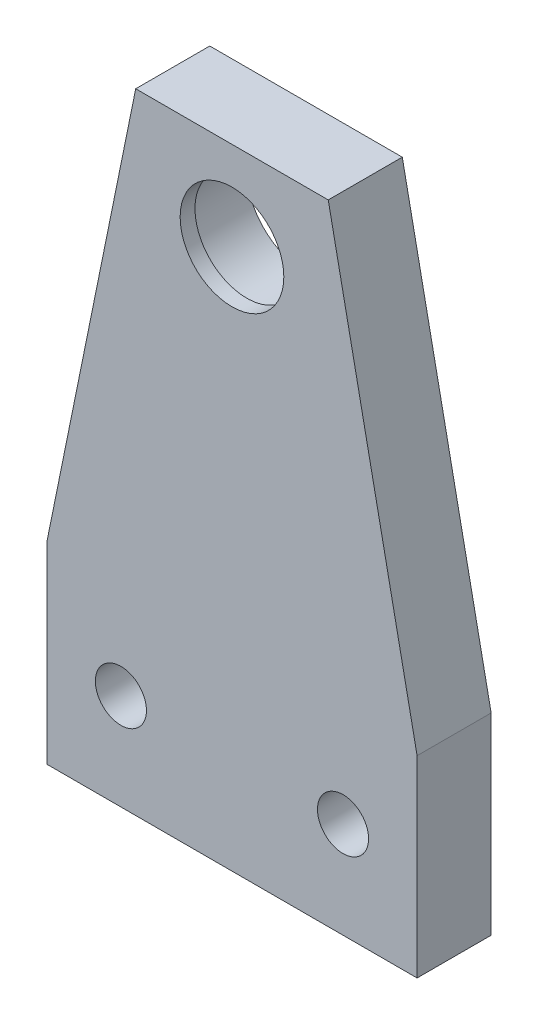
ISO-10303-21;
HEADER;
FILE_DESCRIPTION(('STEP AP214'),'2;1');
FILE_NAME('part.step','',(''),(''),'','','');
FILE_SCHEMA(('AUTOMOTIVE_DESIGN { 1 0 10303 214 1 1 1 1 }'));
ENDSEC;
DATA;
#1=APPLICATION_CONTEXT('core data for automotive mechanical design processes');
#2=APPLICATION_PROTOCOL_DEFINITION('international standard','automotive_design',2000,#1);
#3=PRODUCT_CONTEXT('',#1,'mechanical');
#4=PRODUCT('Part','Part','',(#3));
#5=PRODUCT_RELATED_PRODUCT_CATEGORY('part','',(#4));
#6=PRODUCT_DEFINITION_FORMATION('','',#4);
#7=PRODUCT_DEFINITION_CONTEXT('part definition',#1,'design');
#8=PRODUCT_DEFINITION('design','',#6,#7);
#9=PRODUCT_DEFINITION_SHAPE('','',#8);
#10=(LENGTH_UNIT() NAMED_UNIT(*) SI_UNIT(.MILLI.,.METRE.));
#11=(NAMED_UNIT(*) PLANE_ANGLE_UNIT() SI_UNIT($,.RADIAN.));
#12=(NAMED_UNIT(*) SI_UNIT($,.STERADIAN.) SOLID_ANGLE_UNIT());
#13=UNCERTAINTY_MEASURE_WITH_UNIT(LENGTH_MEASURE(1.E-05),#10,'distance_accuracy_value','');
#14=(GEOMETRIC_REPRESENTATION_CONTEXT(3) GLOBAL_UNCERTAINTY_ASSIGNED_CONTEXT((#13)) GLOBAL_UNIT_ASSIGNED_CONTEXT((#10,
#11,#12)) REPRESENTATION_CONTEXT('',''));
#15=CARTESIAN_POINT('',(0.,0.,0.));
#16=DIRECTION('',(0.,0.,1.));
#17=DIRECTION('',(1.,0.,0.));
#18=AXIS2_PLACEMENT_3D('',#15,#16,#17);
#19=CARTESIAN_POINT('',(0.,73.,10.));
#20=DIRECTION('',(0.,0.,-1.));
#21=DIRECTION('',(-1.,0.,0.));
#22=AXIS2_PLACEMENT_3D('',#19,#20,#21);
#23=CYLINDRICAL_SURFACE('',#22,7.);
#24=CARTESIAN_POINT('',(0.,73.,10.));
#25=DIRECTION('',(0.,0.,1.));
#26=DIRECTION('',(1.,0.,0.));
#27=AXIS2_PLACEMENT_3D('',#24,#25,#26);
#28=CIRCLE('',#27,7.);
#29=CARTESIAN_POINT('',(7.,73.,10.));
#30=VERTEX_POINT('',#29);
#31=EDGE_CURVE('E125',#30,#30,#28,.T.);
#32=ORIENTED_EDGE('',*,*,#31,.T.);
#33=EDGE_LOOP('',(#32));
#34=FACE_BOUND('',#33,.T.);
#35=CARTESIAN_POINT('',(0.,73.,8.));
#36=DIRECTION('',(0.,0.,-1.));
#37=DIRECTION('',(-1.,0.,0.));
#38=AXIS2_PLACEMENT_3D('',#35,#36,#37);
#39=CIRCLE('',#38,7.);
#40=CARTESIAN_POINT('',(-7.,73.,8.));
#41=VERTEX_POINT('',#40);
#42=EDGE_CURVE('E38',#41,#41,#39,.T.);
#43=ORIENTED_EDGE('',*,*,#42,.T.);
#44=EDGE_LOOP('',(#43));
#45=FACE_BOUND('',#44,.T.);
#46=ADVANCED_FACE('F34',(#34,#45),#23,.F.);
#47=CARTESIAN_POINT('',(0.,0.,10.));
#48=DIRECTION('',(0.,0.,1.));
#49=DIRECTION('',(1.,0.,0.));
#50=AXIS2_PLACEMENT_3D('',#47,#48,#49);
#51=PLANE('',#50);
#52=CARTESIAN_POINT('',(15.,13.,10.));
#53=DIRECTION('',(0.,0.,1.));
#54=DIRECTION('',(-1.,0.,0.));
#55=AXIS2_PLACEMENT_3D('',#52,#53,#54);
#56=CIRCLE('',#55,3.45000000000001);
#57=CARTESIAN_POINT('',(11.55,13.,10.));
#58=VERTEX_POINT('',#57);
#59=EDGE_CURVE('E193',#58,#58,#56,.T.);
#60=ORIENTED_EDGE('',*,*,#59,.F.);
#61=EDGE_LOOP('',(#60));
#62=FACE_BOUND('',#61,.T.);
#63=DIRECTION('',(0.,-1.,0.));
#64=VECTOR('',#63,1.);
#65=CARTESIAN_POINT('',(-25.,26.,10.));
#66=LINE('',#65,#64);
#67=CARTESIAN_POINT('',(-25.,26.,10.));
#68=VERTEX_POINT('',#67);
#69=CARTESIAN_POINT('',(-25.,0.,10.));
#70=VERTEX_POINT('',#69);
#71=EDGE_CURVE('E132',#68,#70,#66,.T.);
#72=ORIENTED_EDGE('',*,*,#71,.T.);
#73=DIRECTION('',(1.,0.,0.));
#74=VECTOR('',#73,1.);
#75=CARTESIAN_POINT('',(-25.,0.,10.));
#76=LINE('',#75,#74);
#77=CARTESIAN_POINT('',(25.,0.,10.));
#78=VERTEX_POINT('',#77);
#79=EDGE_CURVE('E89',#70,#78,#76,.T.);
#80=ORIENTED_EDGE('',*,*,#79,.T.);
#81=DIRECTION('',(0.,1.,0.));
#82=VECTOR('',#81,1.);
#83=CARTESIAN_POINT('',(25.,0.,10.));
#84=LINE('',#83,#82);
#85=CARTESIAN_POINT('',(25.,26.,10.));
#86=VERTEX_POINT('',#85);
#87=EDGE_CURVE('E103',#78,#86,#84,.T.);
#88=ORIENTED_EDGE('',*,*,#87,.T.);
#89=DIRECTION('',(-0.199309151648976,0.979936662274132,0.));
#90=VECTOR('',#89,1.);
#91=CARTESIAN_POINT('',(13.,85.,10.));
#92=LINE('',#91,#90);
#93=CARTESIAN_POINT('',(13.,85.,10.));
#94=VERTEX_POINT('',#93);
#95=EDGE_CURVE('E96',#86,#94,#92,.T.);
#96=ORIENTED_EDGE('',*,*,#95,.T.);
#97=DIRECTION('',(-1.,0.,0.));
#98=VECTOR('',#97,1.);
#99=CARTESIAN_POINT('',(13.,85.,10.));
#100=LINE('',#99,#98);
#101=CARTESIAN_POINT('',(-13.,85.,10.));
#102=VERTEX_POINT('',#101);
#103=EDGE_CURVE('E101',#94,#102,#100,.T.);
#104=ORIENTED_EDGE('',*,*,#103,.T.);
#105=DIRECTION('',(-0.199309151648976,-0.979936662274132,0.));
#106=VECTOR('',#105,1.);
#107=CARTESIAN_POINT('',(-13.,85.,10.));
#108=LINE('',#107,#106);
#109=EDGE_CURVE('E52',#102,#68,#108,.T.);
#110=ORIENTED_EDGE('',*,*,#109,.T.);
#111=EDGE_LOOP('',(#72,#80,#88,#96,#104,#110));
#112=FACE_BOUND('',#111,.T.);
#113=ORIENTED_EDGE('',*,*,#31,.F.);
#114=EDGE_LOOP('',(#113));
#115=FACE_BOUND('',#114,.T.);
#116=CARTESIAN_POINT('',(-15.,13.,10.));
#117=DIRECTION('',(0.,0.,1.));
#118=DIRECTION('',(1.,0.,0.));
#119=AXIS2_PLACEMENT_3D('',#116,#117,#118);
#120=CIRCLE('',#119,3.45);
#121=CARTESIAN_POINT('',(-11.55,13.,10.));
#122=VERTEX_POINT('',#121);
#123=EDGE_CURVE('E186',#122,#122,#120,.T.);
#124=ORIENTED_EDGE('',*,*,#123,.F.);
#125=EDGE_LOOP('',(#124));
#126=FACE_BOUND('',#125,.T.);
#127=ADVANCED_FACE('F98',(#62,#112,#115,#126),#51,.T.);
#128=CARTESIAN_POINT('',(0.,0.,0.));
#129=DIRECTION('',(0.,0.,1.));
#130=DIRECTION('',(1.,0.,0.));
#131=AXIS2_PLACEMENT_3D('',#128,#129,#130);
#132=PLANE('',#131);
#133=CARTESIAN_POINT('',(0.,73.,0.));
#134=DIRECTION('',(0.,0.,-1.));
#135=DIRECTION('',(-1.,0.,0.));
#136=AXIS2_PLACEMENT_3D('',#133,#134,#135);
#137=CIRCLE('',#136,8.05);
#138=CARTESIAN_POINT('',(-8.05,73.,0.));
#139=VERTEX_POINT('',#138);
#140=EDGE_CURVE('E179',#139,#139,#137,.T.);
#141=ORIENTED_EDGE('',*,*,#140,.F.);
#142=EDGE_LOOP('',(#141));
#143=FACE_BOUND('',#142,.T.);
#144=DIRECTION('',(0.,-1.,0.));
#145=VECTOR('',#144,1.);
#146=CARTESIAN_POINT('',(-25.,26.,0.));
#147=LINE('',#146,#145);
#148=CARTESIAN_POINT('',(-25.,26.,0.));
#149=VERTEX_POINT('',#148);
#150=CARTESIAN_POINT('',(-25.,0.,0.));
#151=VERTEX_POINT('',#150);
#152=EDGE_CURVE('E121',#149,#151,#147,.T.);
#153=ORIENTED_EDGE('',*,*,#152,.F.);
#154=DIRECTION('',(-0.199309151648976,-0.979936662274132,0.));
#155=VECTOR('',#154,1.);
#156=CARTESIAN_POINT('',(-13.,85.,0.));
#157=LINE('',#156,#155);
#158=CARTESIAN_POINT('',(-13.,85.,0.));
#159=VERTEX_POINT('',#158);
#160=EDGE_CURVE('E81',#159,#149,#157,.T.);
#161=ORIENTED_EDGE('',*,*,#160,.F.);
#162=DIRECTION('',(-1.,0.,0.));
#163=VECTOR('',#162,1.);
#164=CARTESIAN_POINT('',(13.,85.,0.));
#165=LINE('',#164,#163);
#166=CARTESIAN_POINT('',(13.,85.,0.));
#167=VERTEX_POINT('',#166);
#168=EDGE_CURVE('E75',#167,#159,#165,.T.);
#169=ORIENTED_EDGE('',*,*,#168,.F.);
#170=DIRECTION('',(-0.199309151648976,0.979936662274132,0.));
#171=VECTOR('',#170,1.);
#172=CARTESIAN_POINT('',(13.,85.,0.));
#173=LINE('',#172,#171);
#174=CARTESIAN_POINT('',(25.,26.,0.));
#175=VERTEX_POINT('',#174);
#176=EDGE_CURVE('E111',#175,#167,#173,.T.);
#177=ORIENTED_EDGE('',*,*,#176,.F.);
#178=DIRECTION('',(0.,1.,0.));
#179=VECTOR('',#178,1.);
#180=CARTESIAN_POINT('',(25.,0.,0.));
#181=LINE('',#180,#179);
#182=CARTESIAN_POINT('',(25.,0.,0.));
#183=VERTEX_POINT('',#182);
#184=EDGE_CURVE('E127',#183,#175,#181,.T.);
#185=ORIENTED_EDGE('',*,*,#184,.F.);
#186=DIRECTION('',(1.,0.,0.));
#187=VECTOR('',#186,1.);
#188=CARTESIAN_POINT('',(-25.,0.,0.));
#189=LINE('',#188,#187);
#190=EDGE_CURVE('E124',#151,#183,#189,.T.);
#191=ORIENTED_EDGE('',*,*,#190,.F.);
#192=EDGE_LOOP('',(#153,#161,#169,#177,#185,#191));
#193=FACE_BOUND('',#192,.T.);
#194=CARTESIAN_POINT('',(15.,13.,0.));
#195=DIRECTION('',(0.,0.,1.));
#196=DIRECTION('',(-1.,0.,0.));
#197=AXIS2_PLACEMENT_3D('',#194,#195,#196);
#198=CIRCLE('',#197,3.45000000000001);
#199=CARTESIAN_POINT('',(11.55,13.,0.));
#200=VERTEX_POINT('',#199);
#201=EDGE_CURVE('E189',#200,#200,#198,.T.);
#202=ORIENTED_EDGE('',*,*,#201,.T.);
#203=EDGE_LOOP('',(#202));
#204=FACE_BOUND('',#203,.T.);
#205=CARTESIAN_POINT('',(-15.,13.,0.));
#206=DIRECTION('',(0.,0.,1.));
#207=DIRECTION('',(1.,0.,0.));
#208=AXIS2_PLACEMENT_3D('',#205,#206,#207);
#209=CIRCLE('',#208,3.45);
#210=CARTESIAN_POINT('',(-11.55,13.,0.));
#211=VERTEX_POINT('',#210);
#212=EDGE_CURVE('E190',#211,#211,#209,.T.);
#213=ORIENTED_EDGE('',*,*,#212,.T.);
#214=EDGE_LOOP('',(#213));
#215=FACE_BOUND('',#214,.T.);
#216=ADVANCED_FACE('F142',(#143,#193,#204,#215),#132,.F.);
#217=CARTESIAN_POINT('',(-25.,26.,10.));
#218=DIRECTION('',(1.,0.,0.));
#219=DIRECTION('',(0.,1.,0.));
#220=AXIS2_PLACEMENT_3D('',#217,#218,#219);
#221=PLANE('',#220);
#222=ORIENTED_EDGE('',*,*,#152,.T.);
#223=DIRECTION('',(0.,0.,-1.));
#224=VECTOR('',#223,1.);
#225=CARTESIAN_POINT('',(-25.,0.,10.));
#226=LINE('',#225,#224);
#227=EDGE_CURVE('E11',#70,#151,#226,.T.);
#228=ORIENTED_EDGE('',*,*,#227,.F.);
#229=ORIENTED_EDGE('',*,*,#71,.F.);
#230=DIRECTION('',(0.,0.,-1.));
#231=VECTOR('',#230,1.);
#232=CARTESIAN_POINT('',(-25.,26.,10.));
#233=LINE('',#232,#231);
#234=EDGE_CURVE('E117',#68,#149,#233,.T.);
#235=ORIENTED_EDGE('',*,*,#234,.T.);
#236=EDGE_LOOP('',(#222,#228,#229,#235));
#237=FACE_BOUND('',#236,.T.);
#238=ADVANCED_FACE('F36',(#237),#221,.F.);
#239=CARTESIAN_POINT('',(-25.,0.,10.));
#240=DIRECTION('',(0.,1.,0.));
#241=DIRECTION('',(0.,0.,1.));
#242=AXIS2_PLACEMENT_3D('',#239,#240,#241);
#243=PLANE('',#242);
#244=ORIENTED_EDGE('',*,*,#190,.T.);
#245=DIRECTION('',(0.,0.,-1.));
#246=VECTOR('',#245,1.);
#247=CARTESIAN_POINT('',(25.,0.,10.));
#248=LINE('',#247,#246);
#249=EDGE_CURVE('E44',#78,#183,#248,.T.);
#250=ORIENTED_EDGE('',*,*,#249,.F.);
#251=ORIENTED_EDGE('',*,*,#79,.F.);
#252=ORIENTED_EDGE('',*,*,#227,.T.);
#253=EDGE_LOOP('',(#244,#250,#251,#252));
#254=FACE_BOUND('',#253,.T.);
#255=ADVANCED_FACE('F176',(#254),#243,.F.);
#256=CARTESIAN_POINT('',(25.,0.,10.));
#257=DIRECTION('',(-1.,0.,0.));
#258=DIRECTION('',(0.,-1.,0.));
#259=AXIS2_PLACEMENT_3D('',#256,#257,#258);
#260=PLANE('',#259);
#261=ORIENTED_EDGE('',*,*,#184,.T.);
#262=DIRECTION('',(0.,0.,-1.));
#263=VECTOR('',#262,1.);
#264=CARTESIAN_POINT('',(25.,26.,10.));
#265=LINE('',#264,#263);
#266=EDGE_CURVE('E112',#86,#175,#265,.T.);
#267=ORIENTED_EDGE('',*,*,#266,.F.);
#268=ORIENTED_EDGE('',*,*,#87,.F.);
#269=ORIENTED_EDGE('',*,*,#249,.T.);
#270=EDGE_LOOP('',(#261,#267,#268,#269));
#271=FACE_BOUND('',#270,.T.);
#272=ADVANCED_FACE('F139',(#271),#260,.F.);
#273=CARTESIAN_POINT('',(13.,85.,10.));
#274=DIRECTION('',(-0.979936662274132,-0.199309151648976,0.));
#275=DIRECTION('',(0.199309151648976,-0.979936662274132,0.));
#276=AXIS2_PLACEMENT_3D('',#273,#274,#275);
#277=PLANE('',#276);
#278=ORIENTED_EDGE('',*,*,#176,.T.);
#279=DIRECTION('',(0.,0.,-1.));
#280=VECTOR('',#279,1.);
#281=CARTESIAN_POINT('',(13.,85.,10.));
#282=LINE('',#281,#280);
#283=EDGE_CURVE('E108',#94,#167,#282,.T.);
#284=ORIENTED_EDGE('',*,*,#283,.F.);
#285=ORIENTED_EDGE('',*,*,#95,.F.);
#286=ORIENTED_EDGE('',*,*,#266,.T.);
#287=EDGE_LOOP('',(#278,#284,#285,#286));
#288=FACE_BOUND('',#287,.T.);
#289=ADVANCED_FACE('F109',(#288),#277,.F.);
#290=CARTESIAN_POINT('',(13.,85.,10.));
#291=DIRECTION('',(0.,-1.,0.));
#292=DIRECTION('',(0.,0.,-1.));
#293=AXIS2_PLACEMENT_3D('',#290,#291,#292);
#294=PLANE('',#293);
#295=ORIENTED_EDGE('',*,*,#168,.T.);
#296=DIRECTION('',(0.,0.,-1.));
#297=VECTOR('',#296,1.);
#298=CARTESIAN_POINT('',(-13.,85.,10.));
#299=LINE('',#298,#297);
#300=EDGE_CURVE('E113',#102,#159,#299,.T.);
#301=ORIENTED_EDGE('',*,*,#300,.F.);
#302=ORIENTED_EDGE('',*,*,#103,.F.);
#303=ORIENTED_EDGE('',*,*,#283,.T.);
#304=EDGE_LOOP('',(#295,#301,#302,#303));
#305=FACE_BOUND('',#304,.T.);
#306=ADVANCED_FACE('F115',(#305),#294,.F.);
#307=CARTESIAN_POINT('',(-13.,85.,10.));
#308=DIRECTION('',(0.979936662274132,-0.199309151648976,0.));
#309=DIRECTION('',(0.199309151648976,0.979936662274132,0.));
#310=AXIS2_PLACEMENT_3D('',#307,#308,#309);
#311=PLANE('',#310);
#312=ORIENTED_EDGE('',*,*,#160,.T.);
#313=ORIENTED_EDGE('',*,*,#234,.F.);
#314=ORIENTED_EDGE('',*,*,#109,.F.);
#315=ORIENTED_EDGE('',*,*,#300,.T.);
#316=EDGE_LOOP('',(#312,#313,#314,#315));
#317=FACE_BOUND('',#316,.T.);
#318=ADVANCED_FACE('F147',(#317),#311,.F.);
#319=CARTESIAN_POINT('',(15.,13.,10.));
#320=DIRECTION('',(0.,0.,-1.));
#321=DIRECTION('',(-1.,0.,0.));
#322=AXIS2_PLACEMENT_3D('',#319,#320,#321);
#323=CYLINDRICAL_SURFACE('',#322,3.45000000000001);
#324=ORIENTED_EDGE('',*,*,#59,.T.);
#325=EDGE_LOOP('',(#324));
#326=FACE_BOUND('',#325,.T.);
#327=ORIENTED_EDGE('',*,*,#201,.F.);
#328=EDGE_LOOP('',(#327));
#329=FACE_BOUND('',#328,.T.);
#330=ADVANCED_FACE('F149',(#326,#329),#323,.F.);
#331=CARTESIAN_POINT('',(-15.,13.,10.));
#332=DIRECTION('',(0.,0.,-1.));
#333=DIRECTION('',(-1.,0.,0.));
#334=AXIS2_PLACEMENT_3D('',#331,#332,#333);
#335=CYLINDRICAL_SURFACE('',#334,3.45);
#336=ORIENTED_EDGE('',*,*,#123,.T.);
#337=EDGE_LOOP('',(#336));
#338=FACE_BOUND('',#337,.T.);
#339=ORIENTED_EDGE('',*,*,#212,.F.);
#340=EDGE_LOOP('',(#339));
#341=FACE_BOUND('',#340,.T.);
#342=ADVANCED_FACE('F155',(#338,#341),#335,.F.);
#343=CARTESIAN_POINT('',(0.,73.,8.));
#344=DIRECTION('',(0.,0.,-1.));
#345=DIRECTION('',(-1.,0.,0.));
#346=AXIS2_PLACEMENT_3D('',#343,#344,#345);
#347=CYLINDRICAL_SURFACE('',#346,8.05);
#348=CARTESIAN_POINT('',(0.,73.,8.));
#349=DIRECTION('',(0.,0.,-1.));
#350=DIRECTION('',(-1.,0.,0.));
#351=AXIS2_PLACEMENT_3D('',#348,#349,#350);
#352=CIRCLE('',#351,8.05);
#353=CARTESIAN_POINT('',(-8.05,73.,8.));
#354=VERTEX_POINT('',#353);
#355=EDGE_CURVE('E181',#354,#354,#352,.T.);
#356=ORIENTED_EDGE('',*,*,#355,.F.);
#357=EDGE_LOOP('',(#356));
#358=FACE_BOUND('',#357,.T.);
#359=ORIENTED_EDGE('',*,*,#140,.T.);
#360=EDGE_LOOP('',(#359));
#361=FACE_BOUND('',#360,.T.);
#362=ADVANCED_FACE('F206',(#358,#361),#347,.F.);
#363=CARTESIAN_POINT('',(0.,73.,8.));
#364=DIRECTION('',(0.,0.,-1.));
#365=DIRECTION('',(-1.,0.,0.));
#366=AXIS2_PLACEMENT_3D('',#363,#364,#365);
#367=PLANE('',#366);
#368=ORIENTED_EDGE('',*,*,#42,.F.);
#369=EDGE_LOOP('',(#368));
#370=FACE_BOUND('',#369,.T.);
#371=ORIENTED_EDGE('',*,*,#355,.T.);
#372=EDGE_LOOP('',(#371));
#373=FACE_BOUND('',#372,.T.);
#374=ADVANCED_FACE('F212',(#370,#373),#367,.T.);
#375=CLOSED_SHELL('',(#46,#127,#216,#238,#255,#272,#289,#306,#318,#330,#342,#362,#374));
#376=MANIFOLD_SOLID_BREP('B2',#375);
#377=ADVANCED_BREP_SHAPE_REPRESENTATION('',(#18,#376),#14);
#378=SHAPE_DEFINITION_REPRESENTATION(#9,#377);
ENDSEC;
END-ISO-10303-21;
